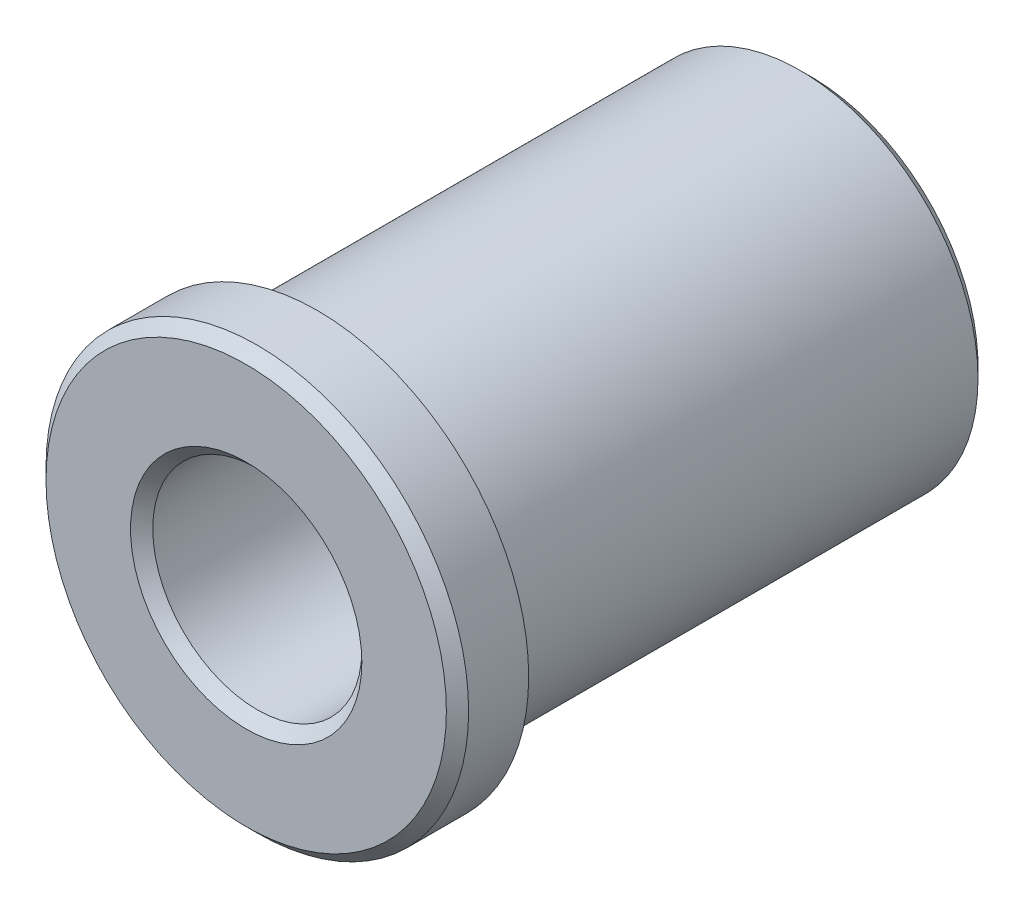
ISO-10303-21;
HEADER;
FILE_DESCRIPTION(('STEP AP214'),'2;1');
FILE_NAME('part.step','',(''),(''),'','','');
FILE_SCHEMA(('AUTOMOTIVE_DESIGN { 1 0 10303 214 1 1 1 1 }'));
ENDSEC;
DATA;
#1=APPLICATION_CONTEXT('core data for automotive mechanical design processes');
#2=APPLICATION_PROTOCOL_DEFINITION('international standard','automotive_design',2000,#1);
#3=PRODUCT_CONTEXT('',#1,'mechanical');
#4=PRODUCT('Part','Part','',(#3));
#5=PRODUCT_RELATED_PRODUCT_CATEGORY('part','',(#4));
#6=PRODUCT_DEFINITION_FORMATION('','',#4);
#7=PRODUCT_DEFINITION_CONTEXT('part definition',#1,'design');
#8=PRODUCT_DEFINITION('design','',#6,#7);
#9=PRODUCT_DEFINITION_SHAPE('','',#8);
#10=(LENGTH_UNIT() NAMED_UNIT(*) SI_UNIT(.MILLI.,.METRE.));
#11=(NAMED_UNIT(*) PLANE_ANGLE_UNIT() SI_UNIT($,.RADIAN.));
#12=(NAMED_UNIT(*) SI_UNIT($,.STERADIAN.) SOLID_ANGLE_UNIT());
#13=UNCERTAINTY_MEASURE_WITH_UNIT(LENGTH_MEASURE(1.E-05),#10,'distance_accuracy_value','');
#14=(GEOMETRIC_REPRESENTATION_CONTEXT(3) GLOBAL_UNCERTAINTY_ASSIGNED_CONTEXT((#13)) GLOBAL_UNIT_ASSIGNED_CONTEXT((#10,
#11,#12)) REPRESENTATION_CONTEXT('',''));
#15=CARTESIAN_POINT('',(0.,0.,0.));
#16=DIRECTION('',(0.,0.,1.));
#17=DIRECTION('',(1.,0.,0.));
#18=AXIS2_PLACEMENT_3D('',#15,#16,#17);
#19=CARTESIAN_POINT('',(2.35,0.,0.));
#20=DIRECTION('',(0.,0.,1.));
#21=DIRECTION('',(1.,0.,0.));
#22=AXIS2_PLACEMENT_3D('',#19,#20,#21);
#23=PLANE('',#22);
#24=CARTESIAN_POINT('',(0.,0.,0.));
#25=DIRECTION('',(0.,0.,1.));
#26=DIRECTION('',(1.,0.,0.));
#27=AXIS2_PLACEMENT_3D('',#24,#25,#26);
#28=CIRCLE('',#27,4.5);
#29=CARTESIAN_POINT('',(4.5,0.,0.));
#30=VERTEX_POINT('',#29);
#31=EDGE_CURVE('E21',#30,#30,#28,.T.);
#32=ORIENTED_EDGE('',*,*,#31,.T.);
#33=EDGE_LOOP('',(#32));
#34=FACE_BOUND('',#33,.T.);
#35=CARTESIAN_POINT('',(0.,0.,0.));
#36=DIRECTION('',(0.,0.,1.));
#37=DIRECTION('',(1.,0.,0.));
#38=AXIS2_PLACEMENT_3D('',#35,#36,#37);
#39=CIRCLE('',#38,2.6);
#40=CARTESIAN_POINT('',(2.6,0.,0.));
#41=VERTEX_POINT('',#40);
#42=EDGE_CURVE('E56',#41,#41,#39,.F.);
#43=ORIENTED_EDGE('',*,*,#42,.T.);
#44=EDGE_LOOP('',(#43));
#45=FACE_BOUND('',#44,.T.);
#46=ADVANCED_FACE('F13',(#34,#45),#23,.T.);
#47=CARTESIAN_POINT('',(4.,0.,-12.7));
#48=DIRECTION('',(0.,0.,-1.));
#49=DIRECTION('',(-1.,0.,0.));
#50=AXIS2_PLACEMENT_3D('',#47,#48,#49);
#51=PLANE('',#50);
#52=CARTESIAN_POINT('',(0.,0.,-12.7));
#53=DIRECTION('',(0.,0.,-1.));
#54=DIRECTION('',(-1.,0.,0.));
#55=AXIS2_PLACEMENT_3D('',#52,#53,#54);
#56=CIRCLE('',#55,3.75);
#57=CARTESIAN_POINT('',(-3.75,0.,-12.7));
#58=VERTEX_POINT('',#57);
#59=EDGE_CURVE('E28',#58,#58,#56,.T.);
#60=ORIENTED_EDGE('',*,*,#59,.T.);
#61=EDGE_LOOP('',(#60));
#62=FACE_BOUND('',#61,.T.);
#63=CARTESIAN_POINT('',(0.,0.,-12.7));
#64=DIRECTION('',(0.,0.,-1.));
#65=DIRECTION('',(-1.,0.,0.));
#66=AXIS2_PLACEMENT_3D('',#63,#64,#65);
#67=CIRCLE('',#66,2.6);
#68=CARTESIAN_POINT('',(-2.6,0.,-12.7));
#69=VERTEX_POINT('',#68);
#70=EDGE_CURVE('E60',#69,#69,#67,.F.);
#71=ORIENTED_EDGE('',*,*,#70,.T.);
#72=EDGE_LOOP('',(#71));
#73=FACE_BOUND('',#72,.T.);
#74=ADVANCED_FACE('F69',(#62,#73),#51,.T.);
#75=CARTESIAN_POINT('',(0.,0.,0.));
#76=DIRECTION('',(0.,0.,1.));
#77=DIRECTION('',(1.,0.,0.));
#78=AXIS2_PLACEMENT_3D('',#75,#76,#77);
#79=CYLINDRICAL_SURFACE('',#78,4.75);
#80=CARTESIAN_POINT('',(0.,0.,-0.250000000000002));
#81=DIRECTION('',(0.,0.,1.));
#82=DIRECTION('',(1.,0.,0.));
#83=AXIS2_PLACEMENT_3D('',#80,#81,#82);
#84=CIRCLE('',#83,4.75);
#85=CARTESIAN_POINT('',(4.75,0.,-0.250000000000002));
#86=VERTEX_POINT('',#85);
#87=EDGE_CURVE('E9',#86,#86,#84,.F.);
#88=ORIENTED_EDGE('',*,*,#87,.T.);
#89=EDGE_LOOP('',(#88));
#90=FACE_BOUND('',#89,.T.);
#91=CARTESIAN_POINT('',(0.,0.,-1.6));
#92=DIRECTION('',(0.,0.,1.));
#93=DIRECTION('',(1.,0.,0.));
#94=AXIS2_PLACEMENT_3D('',#91,#92,#93);
#95=CIRCLE('',#94,4.75);
#96=CARTESIAN_POINT('',(4.75,0.,-1.6));
#97=VERTEX_POINT('',#96);
#98=EDGE_CURVE('E40',#97,#97,#95,.T.);
#99=ORIENTED_EDGE('',*,*,#98,.T.);
#100=EDGE_LOOP('',(#99));
#101=FACE_BOUND('',#100,.T.);
#102=ADVANCED_FACE('F92',(#90,#101),#79,.T.);
#103=CARTESIAN_POINT('',(4.75,0.,-1.6));
#104=DIRECTION('',(0.,0.,-1.));
#105=DIRECTION('',(-1.,0.,0.));
#106=AXIS2_PLACEMENT_3D('',#103,#104,#105);
#107=PLANE('',#106);
#108=CARTESIAN_POINT('',(0.,0.,-1.6));
#109=DIRECTION('',(0.,0.,1.));
#110=DIRECTION('',(1.,0.,0.));
#111=AXIS2_PLACEMENT_3D('',#108,#109,#110);
#112=CIRCLE('',#111,4.);
#113=CARTESIAN_POINT('',(4.,0.,-1.6));
#114=VERTEX_POINT('',#113);
#115=EDGE_CURVE('E44',#114,#114,#112,.T.);
#116=ORIENTED_EDGE('',*,*,#115,.T.);
#117=EDGE_LOOP('',(#116));
#118=FACE_BOUND('',#117,.T.);
#119=ORIENTED_EDGE('',*,*,#98,.F.);
#120=EDGE_LOOP('',(#119));
#121=FACE_BOUND('',#120,.T.);
#122=ADVANCED_FACE('F107',(#118,#121),#107,.T.);
#123=CARTESIAN_POINT('',(0.,0.,0.));
#124=DIRECTION('',(0.,0.,1.));
#125=DIRECTION('',(1.,0.,0.));
#126=AXIS2_PLACEMENT_3D('',#123,#124,#125);
#127=CYLINDRICAL_SURFACE('',#126,4.);
#128=CARTESIAN_POINT('',(0.,0.,-12.45));
#129=DIRECTION('',(0.,0.,-1.));
#130=DIRECTION('',(-1.,0.,0.));
#131=AXIS2_PLACEMENT_3D('',#128,#129,#130);
#132=CIRCLE('',#131,4.);
#133=CARTESIAN_POINT('',(-4.,0.,-12.45));
#134=VERTEX_POINT('',#133);
#135=EDGE_CURVE('E34',#134,#134,#132,.F.);
#136=ORIENTED_EDGE('',*,*,#135,.T.);
#137=EDGE_LOOP('',(#136));
#138=FACE_BOUND('',#137,.T.);
#139=ORIENTED_EDGE('',*,*,#115,.F.);
#140=EDGE_LOOP('',(#139));
#141=FACE_BOUND('',#140,.T.);
#142=ADVANCED_FACE('F100',(#138,#141),#127,.T.);
#143=CARTESIAN_POINT('',(0.,0.,-12.45));
#144=DIRECTION('',(0.,0.,1.));
#145=DIRECTION('',(1.,0.,0.));
#146=AXIS2_PLACEMENT_3D('',#143,#144,#145);
#147=CONICAL_SURFACE('',#146,4.,0.785398163397448);
#148=ORIENTED_EDGE('',*,*,#59,.F.);
#149=EDGE_LOOP('',(#148));
#150=FACE_BOUND('',#149,.T.);
#151=ORIENTED_EDGE('',*,*,#135,.F.);
#152=EDGE_LOOP('',(#151));
#153=FACE_BOUND('',#152,.T.);
#154=ADVANCED_FACE('F98',(#150,#153),#147,.T.);
#155=CARTESIAN_POINT('',(0.,0.,0.));
#156=DIRECTION('',(0.,0.,-1.));
#157=DIRECTION('',(-1.,0.,0.));
#158=AXIS2_PLACEMENT_3D('',#155,#156,#157);
#159=CONICAL_SURFACE('',#158,4.5,0.785398163397447);
#160=ORIENTED_EDGE('',*,*,#87,.F.);
#161=EDGE_LOOP('',(#160));
#162=FACE_BOUND('',#161,.T.);
#163=ORIENTED_EDGE('',*,*,#31,.F.);
#164=EDGE_LOOP('',(#163));
#165=FACE_BOUND('',#164,.T.);
#166=ADVANCED_FACE('F15',(#162,#165),#159,.T.);
#167=CARTESIAN_POINT('',(0.,0.,-0.25));
#168=DIRECTION('',(0.,0.,1.));
#169=DIRECTION('',(1.,0.,0.));
#170=AXIS2_PLACEMENT_3D('',#167,#168,#169);
#171=CONICAL_SURFACE('',#170,2.35,0.785398163397447);
#172=ORIENTED_EDGE('',*,*,#42,.F.);
#173=EDGE_LOOP('',(#172));
#174=FACE_BOUND('',#173,.T.);
#175=CARTESIAN_POINT('',(0.,0.,-0.25));
#176=DIRECTION('',(0.,0.,1.));
#177=DIRECTION('',(1.,0.,0.));
#178=AXIS2_PLACEMENT_3D('',#175,#176,#177);
#179=CIRCLE('',#178,2.35);
#180=CARTESIAN_POINT('',(2.35,0.,-0.25));
#181=VERTEX_POINT('',#180);
#182=EDGE_CURVE('E48',#181,#181,#179,.T.);
#183=ORIENTED_EDGE('',*,*,#182,.F.);
#184=EDGE_LOOP('',(#183));
#185=FACE_BOUND('',#184,.T.);
#186=ADVANCED_FACE('F74',(#174,#185),#171,.F.);
#187=CARTESIAN_POINT('',(0.,0.,-12.7));
#188=DIRECTION('',(0.,0.,-1.));
#189=DIRECTION('',(-1.,0.,0.));
#190=AXIS2_PLACEMENT_3D('',#187,#188,#189);
#191=CONICAL_SURFACE('',#190,2.6,0.785398163397443);
#192=CARTESIAN_POINT('',(0.,0.,-12.45));
#193=DIRECTION('',(0.,0.,-1.));
#194=DIRECTION('',(-1.,0.,0.));
#195=AXIS2_PLACEMENT_3D('',#192,#193,#194);
#196=CIRCLE('',#195,2.35);
#197=CARTESIAN_POINT('',(-2.35,0.,-12.45));
#198=VERTEX_POINT('',#197);
#199=EDGE_CURVE('E52',#198,#198,#196,.T.);
#200=ORIENTED_EDGE('',*,*,#199,.F.);
#201=EDGE_LOOP('',(#200));
#202=FACE_BOUND('',#201,.T.);
#203=ORIENTED_EDGE('',*,*,#70,.F.);
#204=EDGE_LOOP('',(#203));
#205=FACE_BOUND('',#204,.T.);
#206=ADVANCED_FACE('F71',(#202,#205),#191,.F.);
#207=CARTESIAN_POINT('',(0.,0.,0.));
#208=DIRECTION('',(0.,0.,1.));
#209=DIRECTION('',(1.,0.,0.));
#210=AXIS2_PLACEMENT_3D('',#207,#208,#209);
#211=CYLINDRICAL_SURFACE('',#210,2.35);
#212=ORIENTED_EDGE('',*,*,#199,.T.);
#213=EDGE_LOOP('',(#212));
#214=FACE_BOUND('',#213,.T.);
#215=ORIENTED_EDGE('',*,*,#182,.T.);
#216=EDGE_LOOP('',(#215));
#217=FACE_BOUND('',#216,.T.);
#218=ADVANCED_FACE('F73',(#214,#217),#211,.F.);
#219=CLOSED_SHELL('',(#46,#74,#102,#122,#142,#154,#166,#186,#206,#218));
#220=MANIFOLD_SOLID_BREP('B1',#219);
#221=ADVANCED_BREP_SHAPE_REPRESENTATION('',(#18,#220),#14);
#222=SHAPE_DEFINITION_REPRESENTATION(#9,#221);
ENDSEC;
END-ISO-10303-21;
